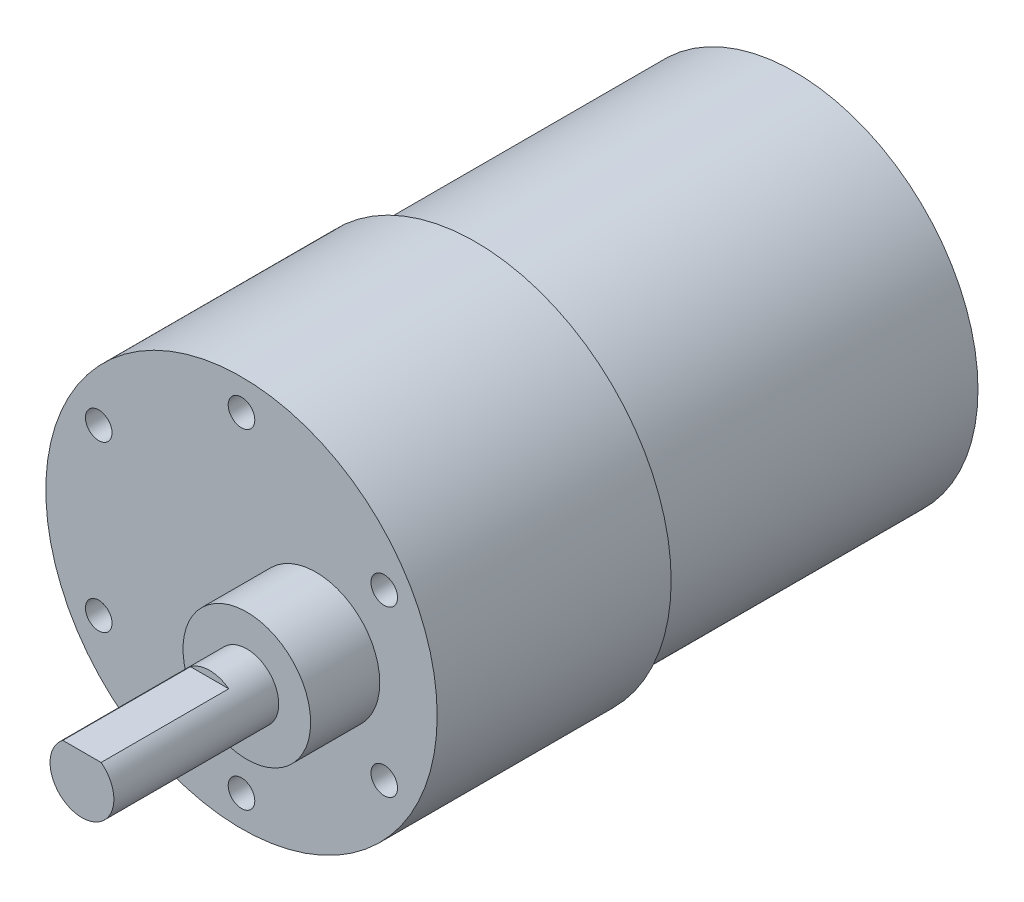
ISO-10303-21;
HEADER;
FILE_DESCRIPTION(('STEP AP214'),'2;1');
FILE_NAME('part.step','',(''),(''),'','','');
FILE_SCHEMA(('AUTOMOTIVE_DESIGN { 1 0 10303 214 1 1 1 1 }'));
ENDSEC;
DATA;
#1=APPLICATION_CONTEXT('core data for automotive mechanical design processes');
#2=APPLICATION_PROTOCOL_DEFINITION('international standard','automotive_design',2000,#1);
#3=PRODUCT_CONTEXT('',#1,'mechanical');
#4=PRODUCT('Part','Part','',(#3));
#5=PRODUCT_RELATED_PRODUCT_CATEGORY('part','',(#4));
#6=PRODUCT_DEFINITION_FORMATION('','',#4);
#7=PRODUCT_DEFINITION_CONTEXT('part definition',#1,'design');
#8=PRODUCT_DEFINITION('design','',#6,#7);
#9=PRODUCT_DEFINITION_SHAPE('','',#8);
#10=(LENGTH_UNIT() NAMED_UNIT(*) SI_UNIT(.MILLI.,.METRE.));
#11=(NAMED_UNIT(*) PLANE_ANGLE_UNIT() SI_UNIT($,.RADIAN.));
#12=(NAMED_UNIT(*) SI_UNIT($,.STERADIAN.) SOLID_ANGLE_UNIT());
#13=UNCERTAINTY_MEASURE_WITH_UNIT(LENGTH_MEASURE(1.E-05),#10,'distance_accuracy_value','');
#14=(GEOMETRIC_REPRESENTATION_CONTEXT(3) GLOBAL_UNCERTAINTY_ASSIGNED_CONTEXT((#13)) GLOBAL_UNIT_ASSIGNED_CONTEXT((#10,
#11,#12)) REPRESENTATION_CONTEXT('',''));
#15=CARTESIAN_POINT('',(0.,0.,0.));
#16=DIRECTION('',(0.,0.,1.));
#17=DIRECTION('',(1.,0.,0.));
#18=AXIS2_PLACEMENT_3D('',#15,#16,#17);
#19=CARTESIAN_POINT('',(0.,0.,22.));
#20=DIRECTION('',(0.,0.,1.));
#21=DIRECTION('',(1.,0.,0.));
#22=AXIS2_PLACEMENT_3D('',#19,#20,#21);
#23=PLANE('',#22);
#24=CARTESIAN_POINT('',(-13.4233937586588,7.75,22.));
#25=DIRECTION('',(0.,0.,1.));
#26=DIRECTION('',(1.,0.,0.));
#27=AXIS2_PLACEMENT_3D('',#24,#25,#26);
#28=CIRCLE('',#27,1.25);
#29=CARTESIAN_POINT('',(-12.1733937586588,7.75,22.));
#30=VERTEX_POINT('',#29);
#31=EDGE_CURVE('E104',#30,#30,#28,.T.);
#32=ORIENTED_EDGE('',*,*,#31,.F.);
#33=EDGE_LOOP('',(#32));
#34=FACE_BOUND('',#33,.T.);
#35=CARTESIAN_POINT('',(0.,15.5,22.));
#36=DIRECTION('',(0.,0.,1.));
#37=DIRECTION('',(1.,0.,0.));
#38=AXIS2_PLACEMENT_3D('',#35,#36,#37);
#39=CIRCLE('',#38,1.25);
#40=CARTESIAN_POINT('',(1.25,15.5,22.));
#41=VERTEX_POINT('',#40);
#42=EDGE_CURVE('E110',#41,#41,#39,.T.);
#43=ORIENTED_EDGE('',*,*,#42,.F.);
#44=EDGE_LOOP('',(#43));
#45=FACE_BOUND('',#44,.T.);
#46=CARTESIAN_POINT('',(13.4233937586588,7.75,22.));
#47=DIRECTION('',(0.,0.,1.));
#48=DIRECTION('',(1.,0.,0.));
#49=AXIS2_PLACEMENT_3D('',#46,#47,#48);
#50=CIRCLE('',#49,1.25);
#51=CARTESIAN_POINT('',(14.6733937586588,7.75,22.));
#52=VERTEX_POINT('',#51);
#53=EDGE_CURVE('E116',#52,#52,#50,.T.);
#54=ORIENTED_EDGE('',*,*,#53,.F.);
#55=EDGE_LOOP('',(#54));
#56=FACE_BOUND('',#55,.T.);
#57=CARTESIAN_POINT('',(13.4233937586588,-7.75000000000001,22.));
#58=DIRECTION('',(0.,0.,1.));
#59=DIRECTION('',(1.,0.,0.));
#60=AXIS2_PLACEMENT_3D('',#57,#58,#59);
#61=CIRCLE('',#60,1.25);
#62=CARTESIAN_POINT('',(14.6733937586588,-7.75000000000001,22.));
#63=VERTEX_POINT('',#62);
#64=EDGE_CURVE('E122',#63,#63,#61,.T.);
#65=ORIENTED_EDGE('',*,*,#64,.F.);
#66=EDGE_LOOP('',(#65));
#67=FACE_BOUND('',#66,.T.);
#68=CARTESIAN_POINT('',(0.,-15.5,22.));
#69=DIRECTION('',(0.,0.,1.));
#70=DIRECTION('',(1.,0.,0.));
#71=AXIS2_PLACEMENT_3D('',#68,#69,#70);
#72=CIRCLE('',#71,1.25);
#73=CARTESIAN_POINT('',(1.25,-15.5,22.));
#74=VERTEX_POINT('',#73);
#75=EDGE_CURVE('E128',#74,#74,#72,.T.);
#76=ORIENTED_EDGE('',*,*,#75,.F.);
#77=EDGE_LOOP('',(#76));
#78=FACE_BOUND('',#77,.T.);
#79=CARTESIAN_POINT('',(-13.4233937586588,-7.75,22.));
#80=DIRECTION('',(0.,0.,1.));
#81=DIRECTION('',(1.,0.,0.));
#82=AXIS2_PLACEMENT_3D('',#79,#80,#81);
#83=CIRCLE('',#82,1.25);
#84=CARTESIAN_POINT('',(-12.1733937586588,-7.75,22.));
#85=VERTEX_POINT('',#84);
#86=EDGE_CURVE('E134',#85,#85,#83,.T.);
#87=ORIENTED_EDGE('',*,*,#86,.F.);
#88=EDGE_LOOP('',(#87));
#89=FACE_BOUND('',#88,.T.);
#90=CARTESIAN_POINT('',(0.,0.,22.));
#91=DIRECTION('',(0.,0.,1.));
#92=DIRECTION('',(1.,0.,0.));
#93=AXIS2_PLACEMENT_3D('',#90,#91,#92);
#94=CIRCLE('',#93,18.4);
#95=CARTESIAN_POINT('',(18.4,0.,22.));
#96=VERTEX_POINT('',#95);
#97=EDGE_CURVE('E45',#96,#96,#94,.T.);
#98=ORIENTED_EDGE('',*,*,#97,.T.);
#99=EDGE_LOOP('',(#98));
#100=FACE_BOUND('',#99,.T.);
#101=CARTESIAN_POINT('',(7.,0.,22.));
#102=DIRECTION('',(0.,0.,1.));
#103=DIRECTION('',(1.,0.,0.));
#104=AXIS2_PLACEMENT_3D('',#101,#102,#103);
#105=CIRCLE('',#104,6.);
#106=CARTESIAN_POINT('',(13.,0.,22.));
#107=VERTEX_POINT('',#106);
#108=EDGE_CURVE('E391',#107,#107,#105,.T.);
#109=ORIENTED_EDGE('',*,*,#108,.F.);
#110=EDGE_LOOP('',(#109));
#111=FACE_BOUND('',#110,.T.);
#112=ADVANCED_FACE('F36',(#34,#45,#56,#67,#78,#89,#100,#111),#23,.T.);
#113=CARTESIAN_POINT('',(0.,0.,0.));
#114=DIRECTION('',(0.,0.,1.));
#115=DIRECTION('',(1.,0.,0.));
#116=AXIS2_PLACEMENT_3D('',#113,#114,#115);
#117=PLANE('',#116);
#118=CARTESIAN_POINT('',(0.,0.,0.));
#119=DIRECTION('',(0.,0.,1.));
#120=DIRECTION('',(1.,0.,0.));
#121=AXIS2_PLACEMENT_3D('',#118,#119,#120);
#122=CIRCLE('',#121,18.4);
#123=CARTESIAN_POINT('',(18.4,0.,0.));
#124=VERTEX_POINT('',#123);
#125=EDGE_CURVE('E140',#124,#124,#122,.T.);
#126=ORIENTED_EDGE('',*,*,#125,.F.);
#127=EDGE_LOOP('',(#126));
#128=FACE_BOUND('',#127,.T.);
#129=CARTESIAN_POINT('',(0.,0.,0.));
#130=DIRECTION('',(0.,0.,1.));
#131=DIRECTION('',(1.,0.,0.));
#132=AXIS2_PLACEMENT_3D('',#129,#130,#131);
#133=CIRCLE('',#132,17.25);
#134=CARTESIAN_POINT('',(17.25,0.,0.));
#135=VERTEX_POINT('',#134);
#136=EDGE_CURVE('E11',#135,#135,#133,.F.);
#137=ORIENTED_EDGE('',*,*,#136,.F.);
#138=EDGE_LOOP('',(#137));
#139=FACE_BOUND('',#138,.T.);
#140=ADVANCED_FACE('F147',(#128,#139),#117,.F.);
#141=CARTESIAN_POINT('',(0.,0.,22.));
#142=DIRECTION('',(0.,0.,-1.));
#143=DIRECTION('',(-1.,0.,0.));
#144=AXIS2_PLACEMENT_3D('',#141,#142,#143);
#145=CYLINDRICAL_SURFACE('',#144,18.4);
#146=ORIENTED_EDGE('',*,*,#97,.F.);
#147=EDGE_LOOP('',(#146));
#148=FACE_BOUND('',#147,.T.);
#149=ORIENTED_EDGE('',*,*,#125,.T.);
#150=EDGE_LOOP('',(#149));
#151=FACE_BOUND('',#150,.T.);
#152=ADVANCED_FACE('F38',(#148,#151),#145,.T.);
#153=CARTESIAN_POINT('',(-13.4233937586588,-7.75,14.38));
#154=DIRECTION('',(0.,0.,1.));
#155=DIRECTION('',(1.,0.,0.));
#156=AXIS2_PLACEMENT_3D('',#153,#154,#155);
#157=CONICAL_SURFACE('',#156,1.25,1.02974425867665);
#158=CARTESIAN_POINT('',(-13.4233937586588,-7.75,13.6289242262155));
#159=VERTEX_POINT('',#158);
#160=VERTEX_LOOP('',#159);
#161=FACE_BOUND('',#160,.T.);
#162=CARTESIAN_POINT('',(-13.4233937586588,-7.75,14.38));
#163=DIRECTION('',(0.,0.,1.));
#164=DIRECTION('',(1.,0.,0.));
#165=AXIS2_PLACEMENT_3D('',#162,#163,#164);
#166=CIRCLE('',#165,1.25);
#167=CARTESIAN_POINT('',(-12.1733937586588,-7.75,14.38));
#168=VERTEX_POINT('',#167);
#169=EDGE_CURVE('E137',#168,#168,#166,.T.);
#170=ORIENTED_EDGE('',*,*,#169,.T.);
#171=EDGE_LOOP('',(#170));
#172=FACE_BOUND('',#171,.T.);
#173=ADVANCED_FACE('F177',(#161,#172),#157,.F.);
#174=CARTESIAN_POINT('',(-13.4233937586588,-7.75,22.));
#175=DIRECTION('',(0.,0.,1.));
#176=DIRECTION('',(1.,0.,0.));
#177=AXIS2_PLACEMENT_3D('',#174,#175,#176);
#178=CYLINDRICAL_SURFACE('',#177,1.25);
#179=ORIENTED_EDGE('',*,*,#169,.F.);
#180=EDGE_LOOP('',(#179));
#181=FACE_BOUND('',#180,.T.);
#182=ORIENTED_EDGE('',*,*,#86,.T.);
#183=EDGE_LOOP('',(#182));
#184=FACE_BOUND('',#183,.T.);
#185=ADVANCED_FACE('F180',(#181,#184),#178,.F.);
#186=CARTESIAN_POINT('',(0.,-15.5,14.38));
#187=DIRECTION('',(0.,0.,1.));
#188=DIRECTION('',(1.,0.,0.));
#189=AXIS2_PLACEMENT_3D('',#186,#187,#188);
#190=CONICAL_SURFACE('',#189,1.25,1.02974425867665);
#191=CARTESIAN_POINT('',(0.,-15.5,13.6289242262155));
#192=VERTEX_POINT('',#191);
#193=VERTEX_LOOP('',#192);
#194=FACE_BOUND('',#193,.T.);
#195=CARTESIAN_POINT('',(0.,-15.5,14.38));
#196=DIRECTION('',(0.,0.,1.));
#197=DIRECTION('',(1.,0.,0.));
#198=AXIS2_PLACEMENT_3D('',#195,#196,#197);
#199=CIRCLE('',#198,1.25);
#200=CARTESIAN_POINT('',(1.25,-15.5,14.38));
#201=VERTEX_POINT('',#200);
#202=EDGE_CURVE('E131',#201,#201,#199,.T.);
#203=ORIENTED_EDGE('',*,*,#202,.T.);
#204=EDGE_LOOP('',(#203));
#205=FACE_BOUND('',#204,.T.);
#206=ADVANCED_FACE('F183',(#194,#205),#190,.F.);
#207=CARTESIAN_POINT('',(0.,-15.5,22.));
#208=DIRECTION('',(0.,0.,1.));
#209=DIRECTION('',(1.,0.,0.));
#210=AXIS2_PLACEMENT_3D('',#207,#208,#209);
#211=CYLINDRICAL_SURFACE('',#210,1.25);
#212=ORIENTED_EDGE('',*,*,#202,.F.);
#213=EDGE_LOOP('',(#212));
#214=FACE_BOUND('',#213,.T.);
#215=ORIENTED_EDGE('',*,*,#75,.T.);
#216=EDGE_LOOP('',(#215));
#217=FACE_BOUND('',#216,.T.);
#218=ADVANCED_FACE('F187',(#214,#217),#211,.F.);
#219=CARTESIAN_POINT('',(13.4233937586588,-7.75000000000001,14.38));
#220=DIRECTION('',(0.,0.,1.));
#221=DIRECTION('',(1.,0.,0.));
#222=AXIS2_PLACEMENT_3D('',#219,#220,#221);
#223=CONICAL_SURFACE('',#222,1.25,1.02974425867665);
#224=CARTESIAN_POINT('',(13.4233937586588,-7.75000000000001,13.6289242262155));
#225=VERTEX_POINT('',#224);
#226=VERTEX_LOOP('',#225);
#227=FACE_BOUND('',#226,.T.);
#228=CARTESIAN_POINT('',(13.4233937586588,-7.75000000000001,14.38));
#229=DIRECTION('',(0.,0.,1.));
#230=DIRECTION('',(1.,0.,0.));
#231=AXIS2_PLACEMENT_3D('',#228,#229,#230);
#232=CIRCLE('',#231,1.25);
#233=CARTESIAN_POINT('',(14.6733937586588,-7.75000000000001,14.38));
#234=VERTEX_POINT('',#233);
#235=EDGE_CURVE('E125',#234,#234,#232,.T.);
#236=ORIENTED_EDGE('',*,*,#235,.T.);
#237=EDGE_LOOP('',(#236));
#238=FACE_BOUND('',#237,.T.);
#239=ADVANCED_FACE('F191',(#227,#238),#223,.F.);
#240=CARTESIAN_POINT('',(13.4233937586588,-7.75000000000001,22.));
#241=DIRECTION('',(0.,0.,1.));
#242=DIRECTION('',(1.,0.,0.));
#243=AXIS2_PLACEMENT_3D('',#240,#241,#242);
#244=CYLINDRICAL_SURFACE('',#243,1.25);
#245=ORIENTED_EDGE('',*,*,#235,.F.);
#246=EDGE_LOOP('',(#245));
#247=FACE_BOUND('',#246,.T.);
#248=ORIENTED_EDGE('',*,*,#64,.T.);
#249=EDGE_LOOP('',(#248));
#250=FACE_BOUND('',#249,.T.);
#251=ADVANCED_FACE('F195',(#247,#250),#244,.F.);
#252=CARTESIAN_POINT('',(13.4233937586588,7.75,14.38));
#253=DIRECTION('',(0.,0.,1.));
#254=DIRECTION('',(1.,0.,0.));
#255=AXIS2_PLACEMENT_3D('',#252,#253,#254);
#256=CONICAL_SURFACE('',#255,1.25,1.02974425867665);
#257=CARTESIAN_POINT('',(13.4233937586588,7.75,13.6289242262155));
#258=VERTEX_POINT('',#257);
#259=VERTEX_LOOP('',#258);
#260=FACE_BOUND('',#259,.T.);
#261=CARTESIAN_POINT('',(13.4233937586588,7.75,14.38));
#262=DIRECTION('',(0.,0.,1.));
#263=DIRECTION('',(1.,0.,0.));
#264=AXIS2_PLACEMENT_3D('',#261,#262,#263);
#265=CIRCLE('',#264,1.25);
#266=CARTESIAN_POINT('',(14.6733937586588,7.75,14.38));
#267=VERTEX_POINT('',#266);
#268=EDGE_CURVE('E119',#267,#267,#265,.T.);
#269=ORIENTED_EDGE('',*,*,#268,.T.);
#270=EDGE_LOOP('',(#269));
#271=FACE_BOUND('',#270,.T.);
#272=ADVANCED_FACE('F199',(#260,#271),#256,.F.);
#273=CARTESIAN_POINT('',(13.4233937586588,7.75,22.));
#274=DIRECTION('',(0.,0.,1.));
#275=DIRECTION('',(1.,0.,0.));
#276=AXIS2_PLACEMENT_3D('',#273,#274,#275);
#277=CYLINDRICAL_SURFACE('',#276,1.25);
#278=ORIENTED_EDGE('',*,*,#268,.F.);
#279=EDGE_LOOP('',(#278));
#280=FACE_BOUND('',#279,.T.);
#281=ORIENTED_EDGE('',*,*,#53,.T.);
#282=EDGE_LOOP('',(#281));
#283=FACE_BOUND('',#282,.T.);
#284=ADVANCED_FACE('F203',(#280,#283),#277,.F.);
#285=CARTESIAN_POINT('',(0.,15.5,14.38));
#286=DIRECTION('',(0.,0.,1.));
#287=DIRECTION('',(1.,0.,0.));
#288=AXIS2_PLACEMENT_3D('',#285,#286,#287);
#289=CONICAL_SURFACE('',#288,1.25,1.02974425867665);
#290=CARTESIAN_POINT('',(0.,15.5,13.6289242262155));
#291=VERTEX_POINT('',#290);
#292=VERTEX_LOOP('',#291);
#293=FACE_BOUND('',#292,.T.);
#294=CARTESIAN_POINT('',(0.,15.5,14.38));
#295=DIRECTION('',(0.,0.,1.));
#296=DIRECTION('',(1.,0.,0.));
#297=AXIS2_PLACEMENT_3D('',#294,#295,#296);
#298=CIRCLE('',#297,1.25);
#299=CARTESIAN_POINT('',(1.24999999999999,15.5,14.38));
#300=VERTEX_POINT('',#299);
#301=EDGE_CURVE('E113',#300,#300,#298,.T.);
#302=ORIENTED_EDGE('',*,*,#301,.T.);
#303=EDGE_LOOP('',(#302));
#304=FACE_BOUND('',#303,.T.);
#305=ADVANCED_FACE('F207',(#293,#304),#289,.F.);
#306=CARTESIAN_POINT('',(0.,15.5,22.));
#307=DIRECTION('',(0.,0.,1.));
#308=DIRECTION('',(1.,0.,0.));
#309=AXIS2_PLACEMENT_3D('',#306,#307,#308);
#310=CYLINDRICAL_SURFACE('',#309,1.25);
#311=ORIENTED_EDGE('',*,*,#301,.F.);
#312=EDGE_LOOP('',(#311));
#313=FACE_BOUND('',#312,.T.);
#314=ORIENTED_EDGE('',*,*,#42,.T.);
#315=EDGE_LOOP('',(#314));
#316=FACE_BOUND('',#315,.T.);
#317=ADVANCED_FACE('F211',(#313,#316),#310,.F.);
#318=CARTESIAN_POINT('',(-13.4233937586588,7.75,14.38));
#319=DIRECTION('',(0.,0.,1.));
#320=DIRECTION('',(1.,0.,0.));
#321=AXIS2_PLACEMENT_3D('',#318,#319,#320);
#322=CONICAL_SURFACE('',#321,1.25,1.02974425867665);
#323=CARTESIAN_POINT('',(-13.4233937586588,7.75,13.6289242262155));
#324=VERTEX_POINT('',#323);
#325=VERTEX_LOOP('',#324);
#326=FACE_BOUND('',#325,.T.);
#327=CARTESIAN_POINT('',(-13.4233937586588,7.75,14.38));
#328=DIRECTION('',(0.,0.,1.));
#329=DIRECTION('',(1.,0.,0.));
#330=AXIS2_PLACEMENT_3D('',#327,#328,#329);
#331=CIRCLE('',#330,1.25);
#332=CARTESIAN_POINT('',(-12.1733937586588,7.75,14.38));
#333=VERTEX_POINT('',#332);
#334=EDGE_CURVE('E107',#333,#333,#331,.T.);
#335=ORIENTED_EDGE('',*,*,#334,.T.);
#336=EDGE_LOOP('',(#335));
#337=FACE_BOUND('',#336,.T.);
#338=ADVANCED_FACE('F165',(#326,#337),#322,.F.);
#339=CARTESIAN_POINT('',(-13.4233937586588,7.75,22.));
#340=DIRECTION('',(0.,0.,1.));
#341=DIRECTION('',(1.,0.,0.));
#342=AXIS2_PLACEMENT_3D('',#339,#340,#341);
#343=CYLINDRICAL_SURFACE('',#342,1.25);
#344=ORIENTED_EDGE('',*,*,#334,.F.);
#345=EDGE_LOOP('',(#344));
#346=FACE_BOUND('',#345,.T.);
#347=ORIENTED_EDGE('',*,*,#31,.T.);
#348=EDGE_LOOP('',(#347));
#349=FACE_BOUND('',#348,.T.);
#350=ADVANCED_FACE('F155',(#346,#349),#343,.F.);
#351=CARTESIAN_POINT('',(0.,0.,-30.));
#352=DIRECTION('',(0.,0.,1.));
#353=DIRECTION('',(1.,0.,0.));
#354=AXIS2_PLACEMENT_3D('',#351,#352,#353);
#355=CYLINDRICAL_SURFACE('',#354,17.25);
#356=CARTESIAN_POINT('',(0.,0.,-30.));
#357=DIRECTION('',(0.,0.,-1.));
#358=DIRECTION('',(-1.,0.,0.));
#359=AXIS2_PLACEMENT_3D('',#356,#357,#358);
#360=CIRCLE('',#359,17.25);
#361=CARTESIAN_POINT('',(-17.25,0.,-30.));
#362=VERTEX_POINT('',#361);
#363=EDGE_CURVE('E101',#362,#362,#360,.T.);
#364=ORIENTED_EDGE('',*,*,#363,.F.);
#365=EDGE_LOOP('',(#364));
#366=FACE_BOUND('',#365,.T.);
#367=ORIENTED_EDGE('',*,*,#136,.T.);
#368=EDGE_LOOP('',(#367));
#369=FACE_BOUND('',#368,.T.);
#370=ADVANCED_FACE('F152',(#366,#369),#355,.T.);
#371=CARTESIAN_POINT('',(0.,0.,-30.));
#372=DIRECTION('',(0.,0.,-1.));
#373=DIRECTION('',(-1.,0.,0.));
#374=AXIS2_PLACEMENT_3D('',#371,#372,#373);
#375=PLANE('',#374);
#376=ORIENTED_EDGE('',*,*,#363,.T.);
#377=EDGE_LOOP('',(#376));
#378=FACE_BOUND('',#377,.T.);
#379=ADVANCED_FACE('F154',(#378),#375,.T.);
#380=CARTESIAN_POINT('',(7.,0.,28.5));
#381=DIRECTION('',(0.,0.,1.));
#382=DIRECTION('',(1.,0.,0.));
#383=AXIS2_PLACEMENT_3D('',#380,#381,#382);
#384=PLANE('',#383);
#385=CARTESIAN_POINT('',(7.,0.,28.5));
#386=DIRECTION('',(0.,0.,1.));
#387=DIRECTION('',(1.,0.,0.));
#388=AXIS2_PLACEMENT_3D('',#385,#386,#387);
#389=CIRCLE('',#388,6.);
#390=CARTESIAN_POINT('',(13.,0.,28.5));
#391=VERTEX_POINT('',#390);
#392=EDGE_CURVE('E388',#391,#391,#389,.T.);
#393=ORIENTED_EDGE('',*,*,#392,.T.);
#394=EDGE_LOOP('',(#393));
#395=FACE_BOUND('',#394,.T.);
#396=CARTESIAN_POINT('',(7.,0.,28.5));
#397=DIRECTION('',(0.,0.,1.));
#398=DIRECTION('',(1.,0.,0.));
#399=AXIS2_PLACEMENT_3D('',#396,#397,#398);
#400=CIRCLE('',#399,3.);
#401=CARTESIAN_POINT('',(10.,0.,28.5));
#402=VERTEX_POINT('',#401);
#403=EDGE_CURVE('E40',#402,#402,#400,.T.);
#404=ORIENTED_EDGE('',*,*,#403,.F.);
#405=EDGE_LOOP('',(#404));
#406=FACE_BOUND('',#405,.T.);
#407=ADVANCED_FACE('F162',(#395,#406),#384,.T.);
#408=CARTESIAN_POINT('',(7.,0.,28.5));
#409=DIRECTION('',(0.,0.,-1.));
#410=DIRECTION('',(-1.,0.,0.));
#411=AXIS2_PLACEMENT_3D('',#408,#409,#410);
#412=CYLINDRICAL_SURFACE('',#411,6.);
#413=ORIENTED_EDGE('',*,*,#392,.F.);
#414=EDGE_LOOP('',(#413));
#415=FACE_BOUND('',#414,.T.);
#416=ORIENTED_EDGE('',*,*,#108,.T.);
#417=EDGE_LOOP('',(#416));
#418=FACE_BOUND('',#417,.T.);
#419=ADVANCED_FACE('F357',(#415,#418),#412,.T.);
#420=CARTESIAN_POINT('',(7.,0.,32.));
#421=DIRECTION('',(0.,0.,1.));
#422=DIRECTION('',(1.,0.,0.));
#423=AXIS2_PLACEMENT_3D('',#420,#421,#422);
#424=PLANE('',#423);
#425=CARTESIAN_POINT('',(7.,0.,32.));
#426=DIRECTION('',(0.,0.,1.));
#427=DIRECTION('',(1.,0.,0.));
#428=AXIS2_PLACEMENT_3D('',#425,#426,#427);
#429=CIRCLE('',#428,3.);
#430=CARTESIAN_POINT('',(8.8,2.4,32.));
#431=VERTEX_POINT('',#430);
#432=CARTESIAN_POINT('',(5.20000000000001,2.4,32.));
#433=VERTEX_POINT('',#432);
#434=EDGE_CURVE('E82',#431,#433,#429,.T.);
#435=ORIENTED_EDGE('',*,*,#434,.T.);
#436=DIRECTION('',(1.,0.,0.));
#437=VECTOR('',#436,1.);
#438=CARTESIAN_POINT('',(5.20000000000001,2.4,32.));
#439=LINE('',#438,#437);
#440=EDGE_CURVE('E84',#433,#431,#439,.T.);
#441=ORIENTED_EDGE('',*,*,#440,.T.);
#442=EDGE_LOOP('',(#435,#441));
#443=FACE_BOUND('',#442,.T.);
#444=ADVANCED_FACE('F83',(#443),#424,.T.);
#445=CARTESIAN_POINT('',(5.20000000000001,2.4,32.));
#446=DIRECTION('',(0.,-1.,0.));
#447=DIRECTION('',(0.,0.,-1.));
#448=AXIS2_PLACEMENT_3D('',#445,#446,#447);
#449=PLANE('',#448);
#450=DIRECTION('',(1.,0.,0.));
#451=VECTOR('',#450,1.);
#452=CARTESIAN_POINT('',(5.20000000000001,2.4,44.));
#453=LINE('',#452,#451);
#454=CARTESIAN_POINT('',(5.2,2.4,44.));
#455=VERTEX_POINT('',#454);
#456=CARTESIAN_POINT('',(8.8,2.4,44.));
#457=VERTEX_POINT('',#456);
#458=EDGE_CURVE('E87',#455,#457,#453,.T.);
#459=ORIENTED_EDGE('',*,*,#458,.T.);
#460=DIRECTION('',(0.,0.,1.));
#461=VECTOR('',#460,1.);
#462=CARTESIAN_POINT('',(8.8,2.4,32.));
#463=LINE('',#462,#461);
#464=EDGE_CURVE('E90',#431,#457,#463,.T.);
#465=ORIENTED_EDGE('',*,*,#464,.F.);
#466=ORIENTED_EDGE('',*,*,#440,.F.);
#467=DIRECTION('',(0.,0.,1.));
#468=VECTOR('',#467,1.);
#469=CARTESIAN_POINT('',(5.20000000000001,2.4,32.));
#470=LINE('',#469,#468);
#471=EDGE_CURVE('E52',#433,#455,#470,.T.);
#472=ORIENTED_EDGE('',*,*,#471,.T.);
#473=EDGE_LOOP('',(#459,#465,#466,#472));
#474=FACE_BOUND('',#473,.T.);
#475=ADVANCED_FACE('F89',(#474),#449,.F.);
#476=CARTESIAN_POINT('',(7.,0.,44.));
#477=DIRECTION('',(0.,0.,1.));
#478=DIRECTION('',(1.,0.,0.));
#479=AXIS2_PLACEMENT_3D('',#476,#477,#478);
#480=PLANE('',#479);
#481=ORIENTED_EDGE('',*,*,#458,.F.);
#482=CARTESIAN_POINT('',(7.,0.,44.));
#483=DIRECTION('',(0.,0.,1.));
#484=DIRECTION('',(1.,0.,0.));
#485=AXIS2_PLACEMENT_3D('',#482,#483,#484);
#486=CIRCLE('',#485,3.);
#487=EDGE_CURVE('E95',#455,#457,#486,.T.);
#488=ORIENTED_EDGE('',*,*,#487,.T.);
#489=EDGE_LOOP('',(#481,#488));
#490=FACE_BOUND('',#489,.T.);
#491=ADVANCED_FACE('F333',(#490),#480,.T.);
#492=CARTESIAN_POINT('',(7.,0.,44.));
#493=DIRECTION('',(0.,0.,-1.));
#494=DIRECTION('',(-1.,0.,0.));
#495=AXIS2_PLACEMENT_3D('',#492,#493,#494);
#496=CYLINDRICAL_SURFACE('',#495,3.);
#497=ORIENTED_EDGE('',*,*,#403,.T.);
#498=EDGE_LOOP('',(#497));
#499=FACE_BOUND('',#498,.T.);
#500=ORIENTED_EDGE('',*,*,#487,.F.);
#501=ORIENTED_EDGE('',*,*,#471,.F.);
#502=ORIENTED_EDGE('',*,*,#434,.F.);
#503=ORIENTED_EDGE('',*,*,#464,.T.);
#504=EDGE_LOOP('',(#500,#501,#502,#503));
#505=FACE_BOUND('',#504,.T.);
#506=ADVANCED_FACE('F93',(#499,#505),#496,.T.);
#507=CLOSED_SHELL('',(#112,#140,#152,#173,#185,#206,#218,#239,#251,#272,#284,#305,#317,#338,
#350,#370,#379,#407,#419,#444,#475,#491,#506));
#508=MANIFOLD_SOLID_BREP('B2',#507);
#509=ADVANCED_BREP_SHAPE_REPRESENTATION('',(#18,#508),#14);
#510=SHAPE_DEFINITION_REPRESENTATION(#9,#509);
ENDSEC;
END-ISO-10303-21;
